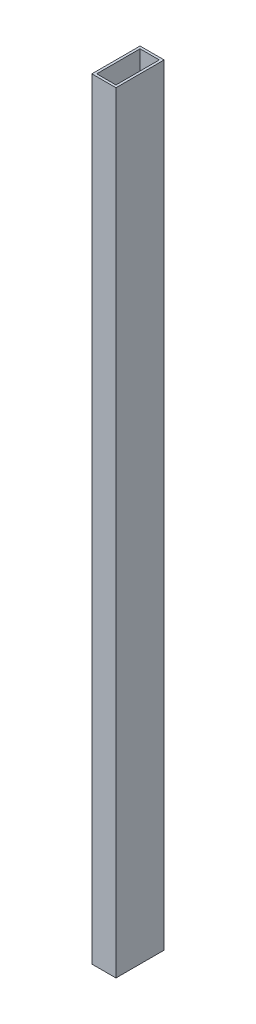
ISO-10303-21;
HEADER;
FILE_DESCRIPTION(('STEP AP214'),'2;1');
FILE_NAME('part.step','',(''),(''),'','','');
FILE_SCHEMA(('AUTOMOTIVE_DESIGN { 1 0 10303 214 1 1 1 1 }'));
ENDSEC;
DATA;
#1=APPLICATION_CONTEXT('core data for automotive mechanical design processes');
#2=APPLICATION_PROTOCOL_DEFINITION('international standard','automotive_design',2000,#1);
#3=PRODUCT_CONTEXT('',#1,'mechanical');
#4=PRODUCT('Part','Part','',(#3));
#5=PRODUCT_RELATED_PRODUCT_CATEGORY('part','',(#4));
#6=PRODUCT_DEFINITION_FORMATION('','',#4);
#7=PRODUCT_DEFINITION_CONTEXT('part definition',#1,'design');
#8=PRODUCT_DEFINITION('design','',#6,#7);
#9=PRODUCT_DEFINITION_SHAPE('','',#8);
#10=(LENGTH_UNIT() NAMED_UNIT(*) SI_UNIT(.MILLI.,.METRE.));
#11=(NAMED_UNIT(*) PLANE_ANGLE_UNIT() SI_UNIT($,.RADIAN.));
#12=(NAMED_UNIT(*) SI_UNIT($,.STERADIAN.) SOLID_ANGLE_UNIT());
#13=UNCERTAINTY_MEASURE_WITH_UNIT(LENGTH_MEASURE(1.E-05),#10,'distance_accuracy_value','');
#14=(GEOMETRIC_REPRESENTATION_CONTEXT(3) GLOBAL_UNCERTAINTY_ASSIGNED_CONTEXT((#13)) GLOBAL_UNIT_ASSIGNED_CONTEXT((#10,
#11,#12)) REPRESENTATION_CONTEXT('',''));
#15=CARTESIAN_POINT('',(0.,0.,0.));
#16=DIRECTION('',(0.,0.,1.));
#17=DIRECTION('',(1.,0.,0.));
#18=AXIS2_PLACEMENT_3D('',#15,#16,#17);
#19=CARTESIAN_POINT('',(0.,320.,0.));
#20=DIRECTION('',(0.,1.,0.));
#21=DIRECTION('',(0.,0.,1.));
#22=AXIS2_PLACEMENT_3D('',#19,#20,#21);
#23=PLANE('',#22);
#24=DIRECTION('',(0.,0.,1.));
#25=VECTOR('',#24,1.);
#26=CARTESIAN_POINT('',(-5.,320.,10.));
#27=LINE('',#26,#25);
#28=CARTESIAN_POINT('',(-5.,320.,-9.99999999999999));
#29=VERTEX_POINT('',#28);
#30=CARTESIAN_POINT('',(-5.,320.,10.));
#31=VERTEX_POINT('',#30);
#32=EDGE_CURVE('E136',#29,#31,#27,.T.);
#33=ORIENTED_EDGE('',*,*,#32,.T.);
#34=DIRECTION('',(1.,0.,0.));
#35=VECTOR('',#34,1.);
#36=CARTESIAN_POINT('',(5.,320.,10.));
#37=LINE('',#36,#35);
#38=CARTESIAN_POINT('',(5.,320.,10.));
#39=VERTEX_POINT('',#38);
#40=EDGE_CURVE('E139',#31,#39,#37,.T.);
#41=ORIENTED_EDGE('',*,*,#40,.T.);
#42=DIRECTION('',(0.,0.,-1.));
#43=VECTOR('',#42,1.);
#44=CARTESIAN_POINT('',(5.,320.,10.));
#45=LINE('',#44,#43);
#46=CARTESIAN_POINT('',(5.,320.,-10.));
#47=VERTEX_POINT('',#46);
#48=EDGE_CURVE('E142',#39,#47,#45,.T.);
#49=ORIENTED_EDGE('',*,*,#48,.T.);
#50=DIRECTION('',(-1.,0.,0.));
#51=VECTOR('',#50,1.);
#52=CARTESIAN_POINT('',(5.,320.,-10.));
#53=LINE('',#52,#51);
#54=EDGE_CURVE('E144',#47,#29,#53,.T.);
#55=ORIENTED_EDGE('',*,*,#54,.T.);
#56=EDGE_LOOP('',(#33,#41,#49,#55));
#57=FACE_BOUND('',#56,.T.);
#58=DIRECTION('',(1.,0.,0.));
#59=VECTOR('',#58,1.);
#60=CARTESIAN_POINT('',(4.,320.,9.));
#61=LINE('',#60,#59);
#62=CARTESIAN_POINT('',(-4.,320.,9.));
#63=VERTEX_POINT('',#62);
#64=CARTESIAN_POINT('',(4.,320.,9.));
#65=VERTEX_POINT('',#64);
#66=EDGE_CURVE('E108',#63,#65,#61,.T.);
#67=ORIENTED_EDGE('',*,*,#66,.F.);
#68=DIRECTION('',(0.,0.,1.));
#69=VECTOR('',#68,1.);
#70=CARTESIAN_POINT('',(-4.,320.,9.));
#71=LINE('',#70,#69);
#72=CARTESIAN_POINT('',(-4.,320.,-9.));
#73=VERTEX_POINT('',#72);
#74=EDGE_CURVE('E100',#73,#63,#71,.T.);
#75=ORIENTED_EDGE('',*,*,#74,.F.);
#76=DIRECTION('',(-1.,0.,0.));
#77=VECTOR('',#76,1.);
#78=CARTESIAN_POINT('',(4.,320.,-9.));
#79=LINE('',#78,#77);
#80=CARTESIAN_POINT('',(4.,320.,-9.));
#81=VERTEX_POINT('',#80);
#82=EDGE_CURVE('E122',#81,#73,#79,.T.);
#83=ORIENTED_EDGE('',*,*,#82,.F.);
#84=DIRECTION('',(0.,0.,-1.));
#85=VECTOR('',#84,1.);
#86=CARTESIAN_POINT('',(4.,320.,9.));
#87=LINE('',#86,#85);
#88=EDGE_CURVE('E120',#65,#81,#87,.T.);
#89=ORIENTED_EDGE('',*,*,#88,.F.);
#90=EDGE_LOOP('',(#67,#75,#83,#89));
#91=FACE_BOUND('',#90,.T.);
#92=ADVANCED_FACE('F35',(#57,#91),#23,.T.);
#93=CARTESIAN_POINT('',(0.,0.,0.));
#94=DIRECTION('',(0.,1.,0.));
#95=DIRECTION('',(0.,0.,1.));
#96=AXIS2_PLACEMENT_3D('',#93,#94,#95);
#97=PLANE('',#96);
#98=DIRECTION('',(0.,0.,1.));
#99=VECTOR('',#98,1.);
#100=CARTESIAN_POINT('',(-5.,0.,10.));
#101=LINE('',#100,#99);
#102=CARTESIAN_POINT('',(-5.,0.,-9.99999999999999));
#103=VERTEX_POINT('',#102);
#104=CARTESIAN_POINT('',(-5.,0.,10.));
#105=VERTEX_POINT('',#104);
#106=EDGE_CURVE('E116',#103,#105,#101,.T.);
#107=ORIENTED_EDGE('',*,*,#106,.F.);
#108=DIRECTION('',(-1.,0.,0.));
#109=VECTOR('',#108,1.);
#110=CARTESIAN_POINT('',(5.,0.,-10.));
#111=LINE('',#110,#109);
#112=CARTESIAN_POINT('',(5.,0.,-10.));
#113=VERTEX_POINT('',#112);
#114=EDGE_CURVE('E140',#113,#103,#111,.T.);
#115=ORIENTED_EDGE('',*,*,#114,.F.);
#116=DIRECTION('',(0.,0.,-1.));
#117=VECTOR('',#116,1.);
#118=CARTESIAN_POINT('',(5.,0.,10.));
#119=LINE('',#118,#117);
#120=CARTESIAN_POINT('',(5.,0.,10.));
#121=VERTEX_POINT('',#120);
#122=EDGE_CURVE('E151',#121,#113,#119,.T.);
#123=ORIENTED_EDGE('',*,*,#122,.F.);
#124=DIRECTION('',(1.,0.,0.));
#125=VECTOR('',#124,1.);
#126=CARTESIAN_POINT('',(5.,0.,10.));
#127=LINE('',#126,#125);
#128=EDGE_CURVE('E149',#105,#121,#127,.T.);
#129=ORIENTED_EDGE('',*,*,#128,.F.);
#130=EDGE_LOOP('',(#107,#115,#123,#129));
#131=FACE_BOUND('',#130,.T.);
#132=DIRECTION('',(0.,0.,1.));
#133=VECTOR('',#132,1.);
#134=CARTESIAN_POINT('',(-4.,0.,9.));
#135=LINE('',#134,#133);
#136=CARTESIAN_POINT('',(-4.,0.,-9.));
#137=VERTEX_POINT('',#136);
#138=CARTESIAN_POINT('',(-4.,0.,9.));
#139=VERTEX_POINT('',#138);
#140=EDGE_CURVE('E58',#137,#139,#135,.T.);
#141=ORIENTED_EDGE('',*,*,#140,.T.);
#142=DIRECTION('',(1.,0.,0.));
#143=VECTOR('',#142,1.);
#144=CARTESIAN_POINT('',(4.,0.,9.));
#145=LINE('',#144,#143);
#146=CARTESIAN_POINT('',(4.,0.,9.));
#147=VERTEX_POINT('',#146);
#148=EDGE_CURVE('E115',#139,#147,#145,.T.);
#149=ORIENTED_EDGE('',*,*,#148,.T.);
#150=DIRECTION('',(0.,0.,-1.));
#151=VECTOR('',#150,1.);
#152=CARTESIAN_POINT('',(4.,0.,9.));
#153=LINE('',#152,#151);
#154=CARTESIAN_POINT('',(4.,0.,-9.));
#155=VERTEX_POINT('',#154);
#156=EDGE_CURVE('E128',#147,#155,#153,.T.);
#157=ORIENTED_EDGE('',*,*,#156,.T.);
#158=DIRECTION('',(-1.,0.,0.));
#159=VECTOR('',#158,1.);
#160=CARTESIAN_POINT('',(4.,0.,-9.));
#161=LINE('',#160,#159);
#162=EDGE_CURVE('E109',#155,#137,#161,.T.);
#163=ORIENTED_EDGE('',*,*,#162,.T.);
#164=EDGE_LOOP('',(#141,#149,#157,#163));
#165=FACE_BOUND('',#164,.T.);
#166=ADVANCED_FACE('F169',(#131,#165),#97,.F.);
#167=CARTESIAN_POINT('',(-5.,320.,10.));
#168=DIRECTION('',(1.,0.,0.));
#169=DIRECTION('',(0.,0.,-1.));
#170=AXIS2_PLACEMENT_3D('',#167,#168,#169);
#171=PLANE('',#170);
#172=ORIENTED_EDGE('',*,*,#106,.T.);
#173=DIRECTION('',(0.,-1.,0.));
#174=VECTOR('',#173,1.);
#175=CARTESIAN_POINT('',(-5.,320.,10.));
#176=LINE('',#175,#174);
#177=EDGE_CURVE('E11',#31,#105,#176,.T.);
#178=ORIENTED_EDGE('',*,*,#177,.F.);
#179=ORIENTED_EDGE('',*,*,#32,.F.);
#180=DIRECTION('',(0.,-1.,0.));
#181=VECTOR('',#180,1.);
#182=CARTESIAN_POINT('',(-5.,320.,-9.99999999999999));
#183=LINE('',#182,#181);
#184=EDGE_CURVE('E146',#29,#103,#183,.T.);
#185=ORIENTED_EDGE('',*,*,#184,.T.);
#186=EDGE_LOOP('',(#172,#178,#179,#185));
#187=FACE_BOUND('',#186,.T.);
#188=ADVANCED_FACE('F37',(#187),#171,.F.);
#189=CARTESIAN_POINT('',(5.,320.,10.));
#190=DIRECTION('',(0.,0.,-1.));
#191=DIRECTION('',(-1.,0.,0.));
#192=AXIS2_PLACEMENT_3D('',#189,#190,#191);
#193=PLANE('',#192);
#194=ORIENTED_EDGE('',*,*,#128,.T.);
#195=DIRECTION('',(0.,-1.,0.));
#196=VECTOR('',#195,1.);
#197=CARTESIAN_POINT('',(5.,320.,10.));
#198=LINE('',#197,#196);
#199=EDGE_CURVE('E43',#39,#121,#198,.T.);
#200=ORIENTED_EDGE('',*,*,#199,.F.);
#201=ORIENTED_EDGE('',*,*,#40,.F.);
#202=ORIENTED_EDGE('',*,*,#177,.T.);
#203=EDGE_LOOP('',(#194,#200,#201,#202));
#204=FACE_BOUND('',#203,.T.);
#205=ADVANCED_FACE('F179',(#204),#193,.F.);
#206=CARTESIAN_POINT('',(5.,320.,10.));
#207=DIRECTION('',(-1.,0.,0.));
#208=DIRECTION('',(0.,0.,1.));
#209=AXIS2_PLACEMENT_3D('',#206,#207,#208);
#210=PLANE('',#209);
#211=ORIENTED_EDGE('',*,*,#122,.T.);
#212=DIRECTION('',(0.,-1.,0.));
#213=VECTOR('',#212,1.);
#214=CARTESIAN_POINT('',(5.,320.,-10.));
#215=LINE('',#214,#213);
#216=EDGE_CURVE('E156',#47,#113,#215,.T.);
#217=ORIENTED_EDGE('',*,*,#216,.F.);
#218=ORIENTED_EDGE('',*,*,#48,.F.);
#219=ORIENTED_EDGE('',*,*,#199,.T.);
#220=EDGE_LOOP('',(#211,#217,#218,#219));
#221=FACE_BOUND('',#220,.T.);
#222=ADVANCED_FACE('F163',(#221),#210,.F.);
#223=CARTESIAN_POINT('',(5.,320.,-10.));
#224=DIRECTION('',(0.,0.,1.));
#225=DIRECTION('',(1.,0.,0.));
#226=AXIS2_PLACEMENT_3D('',#223,#224,#225);
#227=PLANE('',#226);
#228=ORIENTED_EDGE('',*,*,#114,.T.);
#229=ORIENTED_EDGE('',*,*,#184,.F.);
#230=ORIENTED_EDGE('',*,*,#54,.F.);
#231=ORIENTED_EDGE('',*,*,#216,.T.);
#232=EDGE_LOOP('',(#228,#229,#230,#231));
#233=FACE_BOUND('',#232,.T.);
#234=ADVANCED_FACE('F173',(#233),#227,.F.);
#235=CARTESIAN_POINT('',(-4.,320.,9.));
#236=DIRECTION('',(1.,0.,0.));
#237=DIRECTION('',(0.,0.,-1.));
#238=AXIS2_PLACEMENT_3D('',#235,#236,#237);
#239=PLANE('',#238);
#240=ORIENTED_EDGE('',*,*,#140,.F.);
#241=DIRECTION('',(0.,-1.,0.));
#242=VECTOR('',#241,1.);
#243=CARTESIAN_POINT('',(-4.,320.,-9.));
#244=LINE('',#243,#242);
#245=EDGE_CURVE('E104',#73,#137,#244,.T.);
#246=ORIENTED_EDGE('',*,*,#245,.F.);
#247=ORIENTED_EDGE('',*,*,#74,.T.);
#248=DIRECTION('',(0.,-1.,0.));
#249=VECTOR('',#248,1.);
#250=CARTESIAN_POINT('',(-4.,320.,9.));
#251=LINE('',#250,#249);
#252=EDGE_CURVE('E103',#63,#139,#251,.T.);
#253=ORIENTED_EDGE('',*,*,#252,.T.);
#254=EDGE_LOOP('',(#240,#246,#247,#253));
#255=FACE_BOUND('',#254,.T.);
#256=ADVANCED_FACE('F102',(#255),#239,.T.);
#257=CARTESIAN_POINT('',(4.,320.,9.));
#258=DIRECTION('',(0.,0.,-1.));
#259=DIRECTION('',(-1.,0.,0.));
#260=AXIS2_PLACEMENT_3D('',#257,#258,#259);
#261=PLANE('',#260);
#262=ORIENTED_EDGE('',*,*,#148,.F.);
#263=ORIENTED_EDGE('',*,*,#252,.F.);
#264=ORIENTED_EDGE('',*,*,#66,.T.);
#265=DIRECTION('',(0.,-1.,0.));
#266=VECTOR('',#265,1.);
#267=CARTESIAN_POINT('',(4.,320.,9.));
#268=LINE('',#267,#266);
#269=EDGE_CURVE('E117',#65,#147,#268,.T.);
#270=ORIENTED_EDGE('',*,*,#269,.T.);
#271=EDGE_LOOP('',(#262,#263,#264,#270));
#272=FACE_BOUND('',#271,.T.);
#273=ADVANCED_FACE('F112',(#272),#261,.T.);
#274=CARTESIAN_POINT('',(4.,320.,9.));
#275=DIRECTION('',(-1.,0.,0.));
#276=DIRECTION('',(0.,0.,1.));
#277=AXIS2_PLACEMENT_3D('',#274,#275,#276);
#278=PLANE('',#277);
#279=ORIENTED_EDGE('',*,*,#156,.F.);
#280=ORIENTED_EDGE('',*,*,#269,.F.);
#281=ORIENTED_EDGE('',*,*,#88,.T.);
#282=DIRECTION('',(0.,-1.,0.));
#283=VECTOR('',#282,1.);
#284=CARTESIAN_POINT('',(4.,320.,-9.));
#285=LINE('',#284,#283);
#286=EDGE_CURVE('E50',#81,#155,#285,.T.);
#287=ORIENTED_EDGE('',*,*,#286,.T.);
#288=EDGE_LOOP('',(#279,#280,#281,#287));
#289=FACE_BOUND('',#288,.T.);
#290=ADVANCED_FACE('F202',(#289),#278,.T.);
#291=CARTESIAN_POINT('',(4.,320.,-9.));
#292=DIRECTION('',(0.,0.,1.));
#293=DIRECTION('',(1.,0.,0.));
#294=AXIS2_PLACEMENT_3D('',#291,#292,#293);
#295=PLANE('',#294);
#296=ORIENTED_EDGE('',*,*,#162,.F.);
#297=ORIENTED_EDGE('',*,*,#286,.F.);
#298=ORIENTED_EDGE('',*,*,#82,.T.);
#299=ORIENTED_EDGE('',*,*,#245,.T.);
#300=EDGE_LOOP('',(#296,#297,#298,#299));
#301=FACE_BOUND('',#300,.T.);
#302=ADVANCED_FACE('F206',(#301),#295,.T.);
#303=CLOSED_SHELL('',(#92,#166,#188,#205,#222,#234,#256,#273,#290,#302));
#304=MANIFOLD_SOLID_BREP('B2',#303);
#305=ADVANCED_BREP_SHAPE_REPRESENTATION('',(#18,#304),#14);
#306=SHAPE_DEFINITION_REPRESENTATION(#9,#305);
ENDSEC;
END-ISO-10303-21;
